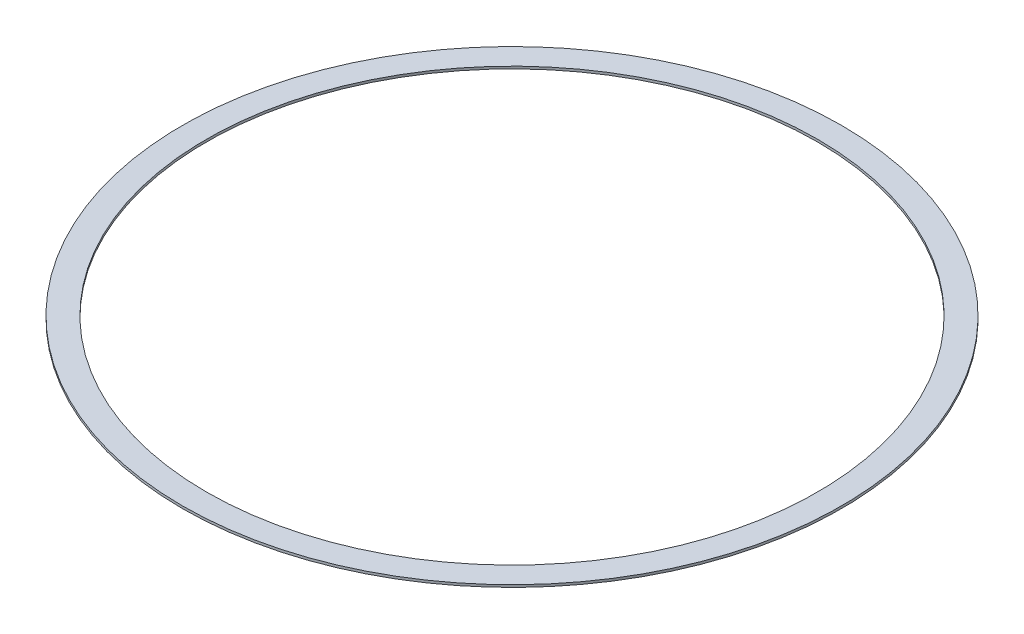
ISO-10303-21;
HEADER;
FILE_DESCRIPTION(('STEP AP214'),'2;1');
FILE_NAME('part.step','',(''),(''),'','','');
FILE_SCHEMA(('AUTOMOTIVE_DESIGN { 1 0 10303 214 1 1 1 1 }'));
ENDSEC;
DATA;
#1=APPLICATION_CONTEXT('core data for automotive mechanical design processes');
#2=APPLICATION_PROTOCOL_DEFINITION('international standard','automotive_design',2000,#1);
#3=PRODUCT_CONTEXT('',#1,'mechanical');
#4=PRODUCT('Part','Part','',(#3));
#5=PRODUCT_RELATED_PRODUCT_CATEGORY('part','',(#4));
#6=PRODUCT_DEFINITION_FORMATION('','',#4);
#7=PRODUCT_DEFINITION_CONTEXT('part definition',#1,'design');
#8=PRODUCT_DEFINITION('design','',#6,#7);
#9=PRODUCT_DEFINITION_SHAPE('','',#8);
#10=(LENGTH_UNIT() NAMED_UNIT(*) SI_UNIT(.MILLI.,.METRE.));
#11=(NAMED_UNIT(*) PLANE_ANGLE_UNIT() SI_UNIT($,.RADIAN.));
#12=(NAMED_UNIT(*) SI_UNIT($,.STERADIAN.) SOLID_ANGLE_UNIT());
#13=UNCERTAINTY_MEASURE_WITH_UNIT(LENGTH_MEASURE(1.E-05),#10,'distance_accuracy_value','');
#14=(GEOMETRIC_REPRESENTATION_CONTEXT(3) GLOBAL_UNCERTAINTY_ASSIGNED_CONTEXT((#13)) GLOBAL_UNIT_ASSIGNED_CONTEXT((#10,
#11,#12)) REPRESENTATION_CONTEXT('',''));
#15=CARTESIAN_POINT('',(0.,0.,0.));
#16=DIRECTION('',(0.,0.,1.));
#17=DIRECTION('',(1.,0.,0.));
#18=AXIS2_PLACEMENT_3D('',#15,#16,#17);
#19=CARTESIAN_POINT('',(0.,2.,0.));
#20=DIRECTION('',(0.,1.,0.));
#21=DIRECTION('',(0.,0.,1.));
#22=AXIS2_PLACEMENT_3D('',#19,#20,#21);
#23=PLANE('',#22);
#24=CARTESIAN_POINT('',(0.,2.,0.));
#25=DIRECTION('',(0.,1.,0.));
#26=DIRECTION('',(0.,0.,1.));
#27=AXIS2_PLACEMENT_3D('',#24,#25,#26);
#28=CIRCLE('',#27,274.629953843705);
#29=CARTESIAN_POINT('',(0.,2.,274.629953843705));
#30=VERTEX_POINT('',#29);
#31=EDGE_CURVE('E10',#30,#30,#28,.T.);
#32=ORIENTED_EDGE('',*,*,#31,.T.);
#33=EDGE_LOOP('',(#32));
#34=FACE_BOUND('',#33,.T.);
#35=CARTESIAN_POINT('',(0.,2.,0.));
#36=DIRECTION('',(0.,1.,0.));
#37=DIRECTION('',(0.,0.,1.));
#38=AXIS2_PLACEMENT_3D('',#35,#36,#37);
#39=CIRCLE('',#38,254.629953843705);
#40=CARTESIAN_POINT('',(0.,2.,254.629953843705));
#41=VERTEX_POINT('',#40);
#42=EDGE_CURVE('E44',#41,#41,#39,.T.);
#43=ORIENTED_EDGE('',*,*,#42,.F.);
#44=EDGE_LOOP('',(#43));
#45=FACE_BOUND('',#44,.T.);
#46=ADVANCED_FACE('F33',(#34,#45),#23,.T.);
#47=CARTESIAN_POINT('',(0.,0.,0.));
#48=DIRECTION('',(0.,1.,0.));
#49=DIRECTION('',(0.,0.,1.));
#50=AXIS2_PLACEMENT_3D('',#47,#48,#49);
#51=PLANE('',#50);
#52=CARTESIAN_POINT('',(0.,0.,0.));
#53=DIRECTION('',(0.,1.,0.));
#54=DIRECTION('',(0.,0.,1.));
#55=AXIS2_PLACEMENT_3D('',#52,#53,#54);
#56=CIRCLE('',#55,274.629953843705);
#57=CARTESIAN_POINT('',(0.,0.,274.629953843705));
#58=VERTEX_POINT('',#57);
#59=EDGE_CURVE('E37',#58,#58,#56,.T.);
#60=ORIENTED_EDGE('',*,*,#59,.F.);
#61=EDGE_LOOP('',(#60));
#62=FACE_BOUND('',#61,.T.);
#63=CARTESIAN_POINT('',(0.,0.,0.));
#64=DIRECTION('',(0.,1.,0.));
#65=DIRECTION('',(0.,0.,1.));
#66=AXIS2_PLACEMENT_3D('',#63,#64,#65);
#67=CIRCLE('',#66,254.629953843705);
#68=CARTESIAN_POINT('',(0.,0.,254.629953843705));
#69=VERTEX_POINT('',#68);
#70=EDGE_CURVE('E46',#69,#69,#67,.T.);
#71=ORIENTED_EDGE('',*,*,#70,.T.);
#72=EDGE_LOOP('',(#71));
#73=FACE_BOUND('',#72,.T.);
#74=ADVANCED_FACE('F56',(#62,#73),#51,.F.);
#75=CARTESIAN_POINT('',(0.,2.,0.));
#76=DIRECTION('',(0.,-1.,0.));
#77=DIRECTION('',(0.,0.,-1.));
#78=AXIS2_PLACEMENT_3D('',#75,#76,#77);
#79=CYLINDRICAL_SURFACE('',#78,274.629953843705);
#80=ORIENTED_EDGE('',*,*,#31,.F.);
#81=EDGE_LOOP('',(#80));
#82=FACE_BOUND('',#81,.T.);
#83=ORIENTED_EDGE('',*,*,#59,.T.);
#84=EDGE_LOOP('',(#83));
#85=FACE_BOUND('',#84,.T.);
#86=ADVANCED_FACE('F35',(#82,#85),#79,.T.);
#87=CARTESIAN_POINT('',(0.,2.,0.));
#88=DIRECTION('',(0.,-1.,0.));
#89=DIRECTION('',(0.,0.,-1.));
#90=AXIS2_PLACEMENT_3D('',#87,#88,#89);
#91=CYLINDRICAL_SURFACE('',#90,254.629953843705);
#92=ORIENTED_EDGE('',*,*,#42,.T.);
#93=EDGE_LOOP('',(#92));
#94=FACE_BOUND('',#93,.T.);
#95=ORIENTED_EDGE('',*,*,#70,.F.);
#96=EDGE_LOOP('',(#95));
#97=FACE_BOUND('',#96,.T.);
#98=ADVANCED_FACE('F52',(#94,#97),#91,.F.);
#99=CLOSED_SHELL('',(#46,#74,#86,#98));
#100=MANIFOLD_SOLID_BREP('B2',#99);
#101=ADVANCED_BREP_SHAPE_REPRESENTATION('',(#18,#100),#14);
#102=SHAPE_DEFINITION_REPRESENTATION(#9,#101);
ENDSEC;
END-ISO-10303-21;
